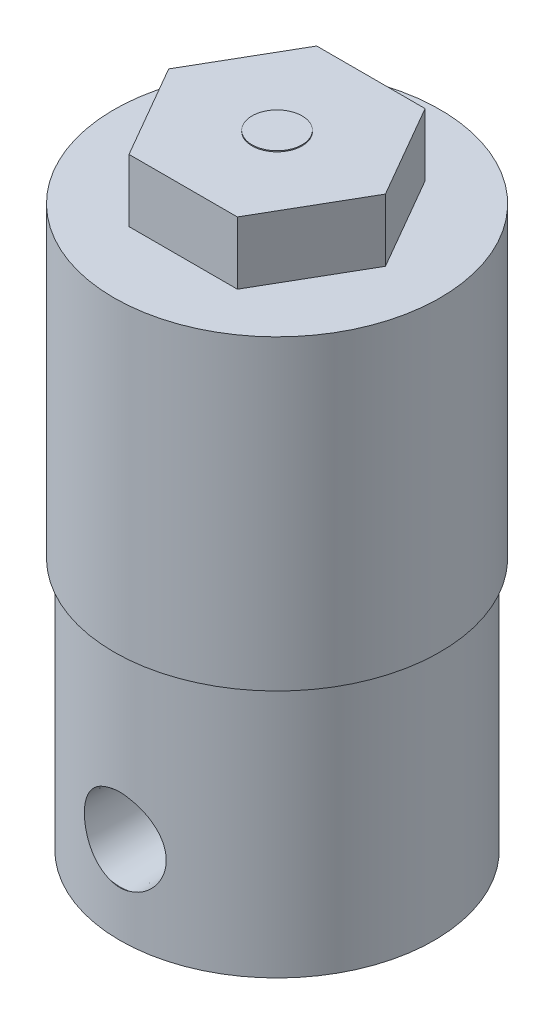
ISO-10303-21;
HEADER;
FILE_DESCRIPTION(('STEP AP214'),'2;1');
FILE_NAME('part.step','',(''),(''),'','','');
FILE_SCHEMA(('AUTOMOTIVE_DESIGN { 1 0 10303 214 1 1 1 1 }'));
ENDSEC;
DATA;
#1=APPLICATION_CONTEXT('core data for automotive mechanical design processes');
#2=APPLICATION_PROTOCOL_DEFINITION('international standard','automotive_design',2000,#1);
#3=PRODUCT_CONTEXT('',#1,'mechanical');
#4=PRODUCT('Part','Part','',(#3));
#5=PRODUCT_RELATED_PRODUCT_CATEGORY('part','',(#4));
#6=PRODUCT_DEFINITION_FORMATION('','',#4);
#7=PRODUCT_DEFINITION_CONTEXT('part definition',#1,'design');
#8=PRODUCT_DEFINITION('design','',#6,#7);
#9=PRODUCT_DEFINITION_SHAPE('','',#8);
#10=(LENGTH_UNIT() NAMED_UNIT(*) SI_UNIT(.MILLI.,.METRE.));
#11=(NAMED_UNIT(*) PLANE_ANGLE_UNIT() SI_UNIT($,.RADIAN.));
#12=(NAMED_UNIT(*) SI_UNIT($,.STERADIAN.) SOLID_ANGLE_UNIT());
#13=UNCERTAINTY_MEASURE_WITH_UNIT(LENGTH_MEASURE(1.E-05),#10,'distance_accuracy_value','');
#14=(GEOMETRIC_REPRESENTATION_CONTEXT(3) GLOBAL_UNCERTAINTY_ASSIGNED_CONTEXT((#13)) GLOBAL_UNIT_ASSIGNED_CONTEXT((#10,
#11,#12)) REPRESENTATION_CONTEXT('',''));
#15=CARTESIAN_POINT('',(0.,0.,0.));
#16=DIRECTION('',(0.,0.,1.));
#17=DIRECTION('',(1.,0.,0.));
#18=AXIS2_PLACEMENT_3D('',#15,#16,#17);
#19=CARTESIAN_POINT('',(0.,44.7,0.));
#20=DIRECTION('',(0.,1.,0.));
#21=DIRECTION('',(0.,0.,1.));
#22=AXIS2_PLACEMENT_3D('',#19,#20,#21);
#23=PLANE('',#22);
#24=CARTESIAN_POINT('',(0.,44.7,0.));
#25=DIRECTION('',(0.,1.,0.));
#26=DIRECTION('',(0.,0.,1.));
#27=AXIS2_PLACEMENT_3D('',#24,#25,#26);
#28=CIRCLE('',#27,13.03);
#29=CARTESIAN_POINT('',(0.,44.7,13.03));
#30=VERTEX_POINT('',#29);
#31=EDGE_CURVE('E194',#30,#30,#28,.T.);
#32=ORIENTED_EDGE('',*,*,#31,.T.);
#33=EDGE_LOOP('',(#32));
#34=FACE_BOUND('',#33,.T.);
#35=DIRECTION('',(-0.5,0.,-0.866025403784439));
#36=VECTOR('',#35,1.);
#37=CARTESIAN_POINT('',(8.66025403784438,44.7,0.));
#38=LINE('',#37,#36);
#39=CARTESIAN_POINT('',(8.66025403784438,44.7,0.));
#40=VERTEX_POINT('',#39);
#41=CARTESIAN_POINT('',(4.33012701892219,44.7,-7.5));
#42=VERTEX_POINT('',#41);
#43=EDGE_CURVE('E171',#40,#42,#38,.T.);
#44=ORIENTED_EDGE('',*,*,#43,.F.);
#45=DIRECTION('',(0.5,0.,-0.866025403784439));
#46=VECTOR('',#45,1.);
#47=CARTESIAN_POINT('',(4.33012701892219,44.7,7.5));
#48=LINE('',#47,#46);
#49=CARTESIAN_POINT('',(4.33012701892219,44.7,7.5));
#50=VERTEX_POINT('',#49);
#51=EDGE_CURVE('E153',#50,#40,#48,.T.);
#52=ORIENTED_EDGE('',*,*,#51,.F.);
#53=DIRECTION('',(1.,0.,0.));
#54=VECTOR('',#53,1.);
#55=CARTESIAN_POINT('',(-4.3301270189222,44.7,7.5));
#56=LINE('',#55,#54);
#57=CARTESIAN_POINT('',(-4.3301270189222,44.7,7.5));
#58=VERTEX_POINT('',#57);
#59=EDGE_CURVE('E158',#58,#50,#56,.T.);
#60=ORIENTED_EDGE('',*,*,#59,.F.);
#61=DIRECTION('',(0.5,0.,0.866025403784439));
#62=VECTOR('',#61,1.);
#63=CARTESIAN_POINT('',(-8.66025403784439,44.7,0.));
#64=LINE('',#63,#62);
#65=CARTESIAN_POINT('',(-8.66025403784439,44.7,0.));
#66=VERTEX_POINT('',#65);
#67=EDGE_CURVE('E177',#66,#58,#64,.T.);
#68=ORIENTED_EDGE('',*,*,#67,.F.);
#69=DIRECTION('',(-0.5,0.,0.866025403784439));
#70=VECTOR('',#69,1.);
#71=CARTESIAN_POINT('',(-4.3301270189222,44.7,-7.5));
#72=LINE('',#71,#70);
#73=CARTESIAN_POINT('',(-4.3301270189222,44.7,-7.5));
#74=VERTEX_POINT('',#73);
#75=EDGE_CURVE('E175',#74,#66,#72,.T.);
#76=ORIENTED_EDGE('',*,*,#75,.F.);
#77=DIRECTION('',(-1.,0.,0.));
#78=VECTOR('',#77,1.);
#79=CARTESIAN_POINT('',(4.33012701892219,44.7,-7.5));
#80=LINE('',#79,#78);
#81=EDGE_CURVE('E173',#42,#74,#80,.T.);
#82=ORIENTED_EDGE('',*,*,#81,.F.);
#83=EDGE_LOOP('',(#44,#52,#60,#68,#76,#82));
#84=FACE_BOUND('',#83,.T.);
#85=ADVANCED_FACE('F38',(#34,#84),#23,.T.);
#86=CARTESIAN_POINT('',(0.,20.19,0.));
#87=DIRECTION('',(0.,-1.,0.));
#88=DIRECTION('',(0.,0.,-1.));
#89=AXIS2_PLACEMENT_3D('',#86,#87,#88);
#90=CYLINDRICAL_SURFACE('',#89,12.56);
#91=CARTESIAN_POINT('',(0.788898573962425,3.76276021112784,-12.5352));
#92=CARTESIAN_POINT('',(0.877992046783151,3.78498595457341,-12.5296008390974));
#93=CARTESIAN_POINT('',(0.966077384943671,3.8109787394763,-12.5230958603472));
#94=CARTESIAN_POINT('',(1.13961109990667,3.87023240902184,-12.5084937022588));
#95=CARTESIAN_POINT('',(1.22506008108899,3.90349161350886,-12.5003968910304));
#96=CARTESIAN_POINT('',(1.39260427157268,3.97696220545809,-12.4828421567203));
#97=CARTESIAN_POINT('',(1.47470476337445,4.0171620739958,-12.4733864931202));
#98=CARTESIAN_POINT('',(1.63513200473562,4.1042165458238,-12.4533725275988));
#99=CARTESIAN_POINT('',(1.71345861244122,4.15107139900257,-12.4428141842769));
#100=CARTESIAN_POINT('',(1.94193866208237,4.30108963824454,-12.4099181050226));
#101=CARTESIAN_POINT('',(2.08580376350805,4.41379985096151,-12.3863360583298));
#102=CARTESIAN_POINT('',(2.35272921182999,4.66140672481568,-12.3384253170528));
#103=CARTESIAN_POINT('',(2.4757843498136,4.79630892417696,-12.3140964373251));
#104=CARTESIAN_POINT('',(2.70011309765983,5.08758685527581,-12.2668817928073));
#105=CARTESIAN_POINT('',(2.80093263275379,5.24431928583219,-12.2440318546701));
#106=CARTESIAN_POINT('',(2.97486996361045,5.57303338337697,-12.2029414624419));
#107=CARTESIAN_POINT('',(3.04798879807883,5.74501447828084,-12.184700835522));
#108=CARTESIAN_POINT('',(3.16368465755467,6.09775236998736,-12.1551741164053));
#109=CARTESIAN_POINT('',(3.2065413683194,6.27841186841878,-12.1438244778716));
#110=CARTESIAN_POINT('',(3.26134510157559,6.64465847523464,-12.1292232211872));
#111=CARTESIAN_POINT('',(3.27329977490954,6.83024435242987,-12.1259695986019));
#112=CARTESIAN_POINT('',(3.26599978076111,7.19557037188689,-12.127936523716));
#113=CARTESIAN_POINT('',(3.24760338180706,7.37532961380296,-12.1329240344468));
#114=CARTESIAN_POINT('',(3.18184035878198,7.72909360076873,-12.1503346674747));
#115=CARTESIAN_POINT('',(3.13447183564151,7.90309796780879,-12.1627582771932));
#116=CARTESIAN_POINT('',(3.01221767228601,8.24070982304539,-12.1936086121537));
#117=CARTESIAN_POINT('',(2.93731132732565,8.40430937937475,-12.2120398531426));
#118=CARTESIAN_POINT('',(2.76213964157896,8.71677696332193,-12.2528463849831));
#119=CARTESIAN_POINT('',(2.66187043273514,8.86564273908765,-12.2752222772706));
#120=CARTESIAN_POINT('',(2.43543081707597,9.14888464802036,-12.322174501744));
#121=CARTESIAN_POINT('',(2.30860961367872,9.28273365259162,-12.3467950977331));
#122=CARTESIAN_POINT('',(2.03425744986368,9.52735745722745,-12.3949490946325));
#123=CARTESIAN_POINT('',(1.88673087447343,9.63813713065744,-12.4184827243438));
#124=CARTESIAN_POINT('',(1.58596026109721,9.82649066148048,-12.4603225808739));
#125=CARTESIAN_POINT('',(1.43389528345359,9.9058827338659,-12.4788833610702));
#126=CARTESIAN_POINT('',(1.19760875195315,10.0064711699788,-12.5030254437535));
#127=CARTESIAN_POINT('',(1.11741366372719,10.0369344736574,-12.5104607952329));
#128=CARTESIAN_POINT('',(0.954748246454062,10.0914873284702,-12.523926455648));
#129=CARTESIAN_POINT('',(0.872277369583635,10.1155753299118,-12.529956422924));
#130=CARTESIAN_POINT('',(0.788898573962424,10.1363836809308,-12.5352));
#131=B_SPLINE_CURVE_WITH_KNOTS('',3,(#91,#92,#93,#94,#95,#96,#97,#98,#99,#100,#101,#102,#103,
#104,#105,#106,#107,#108,#109,#110,#111,#112,#113,#114,#115,#116,#117,#118,#119,#120,#121,#122,
#123,#124,#125,#126,#127,#128,#129,#130),.UNSPECIFIED.,.F.,.F.,(4,2,2,2,2,2,2,2,2,2,2,2,2,2,2,2,
2,2,2,4),(0.,0.275879747322894,0.551695772578802,0.827058370161299,1.10243131008807,
1.65248922542108,2.20268462183557,2.76324638468178,3.32378712580943,3.87907697197291,
4.43422932421709,4.97395047843362,5.51370701417062,6.05387020712794,6.59411582939499,
7.14959960399937,7.70496591409256,8.22029180163628,8.47837183534944,8.73651454502424),.UNSPECIFIED.);
#132=CARTESIAN_POINT('',(0.792070072657664,3.76355342756461,-12.535));
#133=VERTEX_POINT('',#132);
#134=CARTESIAN_POINT('',(0.79207007265764,10.135590464494,-12.535));
#135=VERTEX_POINT('',#134);
#136=EDGE_CURVE('E274',#133,#135,#131,.T.);
#137=ORIENTED_EDGE('',*,*,#136,.T.);
#138=CARTESIAN_POINT('',(0.83370061173436,10.1221594357594,-12.5322999999998));
#139=CARTESIAN_POINT('',(0.75486564278842,10.1483202494265,-12.5375535391951));
#140=CARTESIAN_POINT('',(0.674763011882068,10.1708365129458,-12.542126315415));
#141=CARTESIAN_POINT('',(0.512712357209269,10.208319226797,-12.5497907538505));
#142=CARTESIAN_POINT('',(0.430763677861175,10.2232829494152,-12.552881880926));
#143=CARTESIAN_POINT('',(0.268260713697007,10.2450468578194,-12.557390330899));
#144=CARTESIAN_POINT('',(0.187739079812136,10.2520799781308,-12.5588553923057));
#145=CARTESIAN_POINT('',(0.0264203248663634,10.2586834449056,-12.5602316878031));
#146=CARTESIAN_POINT('',(-0.0543766619753039,10.2582570178965,-12.5601435936903));
#147=CARTESIAN_POINT('',(-0.252425249853426,10.2480207968119,-12.5580085982188));
#148=CARTESIAN_POINT('',(-0.369470439382227,10.2340138359144,-12.5550853323868));
#149=CARTESIAN_POINT('',(-0.603200957254121,10.1901946543597,-12.5460766067035));
#150=CARTESIAN_POINT('',(-0.719817956967926,10.160031279743,-12.5399209528179));
#151=CARTESIAN_POINT('',(-0.833700611730567,10.1221594357607,-12.5323));
#152=B_SPLINE_CURVE_WITH_KNOTS('',3,(#138,#139,#140,#141,#142,#143,#144,#145,#146,#147,#148,
#149,#150,#151),.UNSPECIFIED.,.F.,.F.,(4,2,2,2,2,2,4),(0.,0.249612733617655,0.49931555423555,
0.741475862844617,0.983531430836682,1.3361532903437,1.69677018693214),.UNSPECIFIED.);
#153=CARTESIAN_POINT('',(-0.792070072657664,10.135590464494,-12.535));
#154=VERTEX_POINT('',#153);
#155=EDGE_CURVE('E11',#135,#154,#152,.T.);
#156=ORIENTED_EDGE('',*,*,#155,.T.);
#157=CARTESIAN_POINT('',(-0.78889857396244,10.1363836809308,-12.5352));
#158=CARTESIAN_POINT('',(-0.877992046783166,10.1141579374852,-12.5296008390974));
#159=CARTESIAN_POINT('',(-0.966077384943686,10.0881651525823,-12.5230958603472));
#160=CARTESIAN_POINT('',(-1.13961109990669,10.0289114830368,-12.5084937022588));
#161=CARTESIAN_POINT('',(-1.225060081089,9.99565227854978,-12.5003968910304));
#162=CARTESIAN_POINT('',(-1.39260427157269,9.92218168660055,-12.4828421567203));
#163=CARTESIAN_POINT('',(-1.47470476337446,9.88198181806284,-12.4733864931202));
#164=CARTESIAN_POINT('',(-1.63513200473563,9.79492734623484,-12.4533725275988));
#165=CARTESIAN_POINT('',(-1.71345861244123,9.74807249305606,-12.4428141842769));
#166=CARTESIAN_POINT('',(-1.94193866208238,9.59805425381409,-12.4099181050226));
#167=CARTESIAN_POINT('',(-2.08580376350806,9.48534404109713,-12.3863360583298));
#168=CARTESIAN_POINT('',(-2.35272921183,9.23773716724295,-12.3384253170528));
#169=CARTESIAN_POINT('',(-2.47578434981361,9.10283496788167,-12.3140964373251));
#170=CARTESIAN_POINT('',(-2.70011309765984,8.81155703678282,-12.2668817928073));
#171=CARTESIAN_POINT('',(-2.8009326327538,8.65482460622644,-12.2440318546701));
#172=CARTESIAN_POINT('',(-2.97486996361046,8.32611050868166,-12.2029414624419));
#173=CARTESIAN_POINT('',(-3.04798879807884,8.15412941377779,-12.184700835522));
#174=CARTESIAN_POINT('',(-3.16368465755467,7.80139152207126,-12.1551741164053));
#175=CARTESIAN_POINT('',(-3.2065413683194,7.62073202363984,-12.1438244778716));
#176=CARTESIAN_POINT('',(-3.26134510157559,7.25448541682398,-12.1292232211872));
#177=CARTESIAN_POINT('',(-3.27329977490954,7.06889953962876,-12.1259695986019));
#178=CARTESIAN_POINT('',(-3.26599978076111,6.70357352017174,-12.127936523716));
#179=CARTESIAN_POINT('',(-3.24760338180706,6.52381427825567,-12.1329240344468));
#180=CARTESIAN_POINT('',(-3.18184035878197,6.1700502912899,-12.1503346674747));
#181=CARTESIAN_POINT('',(-3.13447183564151,5.99604592424984,-12.1627582771932));
#182=CARTESIAN_POINT('',(-3.01221767228601,5.65843406901324,-12.1936086121537));
#183=CARTESIAN_POINT('',(-2.93731132732564,5.49483451268388,-12.2120398531426));
#184=CARTESIAN_POINT('',(-2.76213964157895,5.18236692873669,-12.2528463849831));
#185=CARTESIAN_POINT('',(-2.66187043273513,5.03350115297098,-12.2752222772706));
#186=CARTESIAN_POINT('',(-2.43543081707595,4.75025924403827,-12.322174501744));
#187=CARTESIAN_POINT('',(-2.30860961367871,4.61641023946701,-12.3467950977331));
#188=CARTESIAN_POINT('',(-2.03425744986367,4.37178643483119,-12.3949490946325));
#189=CARTESIAN_POINT('',(-1.88673087447342,4.2610067614012,-12.4184827243438));
#190=CARTESIAN_POINT('',(-1.5859602610972,4.07265323057816,-12.4603225808739));
#191=CARTESIAN_POINT('',(-1.43389528345359,3.99326115819274,-12.4788833610702));
#192=CARTESIAN_POINT('',(-1.19760875195315,3.89267272207982,-12.5030254437535));
#193=CARTESIAN_POINT('',(-1.1174136637272,3.86220941840128,-12.5104607952329));
#194=CARTESIAN_POINT('',(-0.954748246454074,3.8076565635884,-12.523926455648));
#195=CARTESIAN_POINT('',(-0.872277369583649,3.78356856214681,-12.529956422924));
#196=CARTESIAN_POINT('',(-0.78889857396244,3.76276021112784,-12.5352));
#197=B_SPLINE_CURVE_WITH_KNOTS('',3,(#157,#158,#159,#160,#161,#162,#163,#164,#165,#166,#167,
#168,#169,#170,#171,#172,#173,#174,#175,#176,#177,#178,#179,#180,#181,#182,#183,#184,#185,#186,
#187,#188,#189,#190,#191,#192,#193,#194,#195,#196),.UNSPECIFIED.,.F.,.F.,(4,2,2,2,2,2,2,2,2,2,2,
2,2,2,2,2,2,2,2,4),(0.,0.275879747322895,0.551695772578802,0.827058370161299,1.10243131008807,
1.65248922542108,2.20268462183557,2.76324638468179,3.32378712580943,3.87907697197291,
4.43422932421709,4.97395047843362,5.51370701417062,6.05387020712794,6.59411582939499,
7.14959960399937,7.70496591409256,8.22029180163626,8.47837183534942,8.73651454502421),.UNSPECIFIED.);
#198=CARTESIAN_POINT('',(-0.792070072657664,3.76355342756461,-12.535));
#199=VERTEX_POINT('',#198);
#200=EDGE_CURVE('E48',#154,#199,#197,.T.);
#201=ORIENTED_EDGE('',*,*,#200,.T.);
#202=CARTESIAN_POINT('',(-0.833700611730567,3.77698445629794,-12.5323));
#203=CARTESIAN_POINT('',(-0.754865642784579,3.75082364263098,-12.5375535391953));
#204=CARTESIAN_POINT('',(-0.674763011878184,3.72830737911185,-12.5421263154152));
#205=CARTESIAN_POINT('',(-0.512712357205311,3.69082466526084,-12.5497907538507));
#206=CARTESIAN_POINT('',(-0.430763677857186,3.67586094264275,-12.5528818809261));
#207=CARTESIAN_POINT('',(-0.268260713692968,3.6540970342388,-12.557390330899));
#208=CARTESIAN_POINT('',(-0.187739079808078,3.64706391392752,-12.5588553923058));
#209=CARTESIAN_POINT('',(-0.0264203248622799,3.64046044715303,-12.5602316878031));
#210=CARTESIAN_POINT('',(0.0543766619793943,3.64088687416224,-12.5601435936902));
#211=CARTESIAN_POINT('',(0.252425249857493,3.65112309524717,-12.5580085982188));
#212=CARTESIAN_POINT('',(0.369470439386257,3.66513005614486,-12.5550853323866));
#213=CARTESIAN_POINT('',(0.603200957258053,3.70894923769991,-12.5460766067034));
#214=CARTESIAN_POINT('',(0.719817956971795,3.73911261231672,-12.5399209528177));
#215=CARTESIAN_POINT('',(0.833700611734362,3.77698445629919,-12.5322999999998));
#216=B_SPLINE_CURVE_WITH_KNOTS('',3,(#202,#203,#204,#205,#206,#207,#208,#209,#210,#211,#212,
#213,#214,#215),.UNSPECIFIED.,.F.,.F.,(4,2,2,2,2,2,4),(0.,0.249612733617679,0.499315554235597,
0.741475862844686,0.983531430836774,1.33615329034375,1.69677018693215),.UNSPECIFIED.);
#217=EDGE_CURVE('E282',#199,#133,#216,.T.);
#218=ORIENTED_EDGE('',*,*,#217,.T.);
#219=EDGE_LOOP('',(#137,#156,#201,#218));
#220=FACE_BOUND('',#219,.T.);
#221=CARTESIAN_POINT('',(-0.833700611730567,10.1325874897314,12.5323));
#222=CARTESIAN_POINT('',(-0.75486564278458,10.1587483033983,12.5375535391953));
#223=CARTESIAN_POINT('',(-0.674763011878186,10.1812645669175,12.5421263154152));
#224=CARTESIAN_POINT('',(-0.512712357205314,10.2187472807685,12.5497907538507));
#225=CARTESIAN_POINT('',(-0.430763677857189,10.2337110033866,12.5528818809261));
#226=CARTESIAN_POINT('',(-0.268260713692973,10.2554749117905,12.557390330899));
#227=CARTESIAN_POINT('',(-0.187739079808084,10.2625080321018,12.5588553923058));
#228=CARTESIAN_POINT('',(-0.0264203248622866,10.2691114988763,12.5602316878031));
#229=CARTESIAN_POINT('',(0.054376661979387,10.2686850718671,12.5601435936902));
#230=CARTESIAN_POINT('',(0.252425249857486,10.2584488507822,12.5580085982188));
#231=CARTESIAN_POINT('',(0.369470439386251,10.2444418898845,12.5550853323866));
#232=CARTESIAN_POINT('',(0.603200957258049,10.2006227083294,12.5460766067034));
#233=CARTESIAN_POINT('',(0.719817956971792,10.1704593337126,12.5399209528177));
#234=CARTESIAN_POINT('',(0.83370061173436,10.1325874897301,12.5322999999998));
#235=B_SPLINE_CURVE_WITH_KNOTS('',3,(#221,#222,#223,#224,#225,#226,#227,#228,#229,#230,#231,
#232,#233,#234),.UNSPECIFIED.,.F.,.F.,(4,2,2,2,2,2,4),(0.,0.249612733617677,0.499315554235593,
0.74147586284468,0.983531430836766,1.33615329034374,1.69677018693214),.UNSPECIFIED.);
#236=CARTESIAN_POINT('',(-0.792070072657664,10.1460185184647,12.535));
#237=VERTEX_POINT('',#236);
#238=CARTESIAN_POINT('',(0.792070072657664,10.1460185184647,12.535));
#239=VERTEX_POINT('',#238);
#240=EDGE_CURVE('E261',#237,#239,#235,.T.);
#241=ORIENTED_EDGE('',*,*,#240,.T.);
#242=CARTESIAN_POINT('',(0.788898573962424,10.1468117349015,12.5352));
#243=CARTESIAN_POINT('',(0.877992046783151,10.1245859914559,12.5296008390974));
#244=CARTESIAN_POINT('',(0.96607738494367,10.098593206553,12.5230958603472));
#245=CARTESIAN_POINT('',(1.13961109990667,10.0393395370075,12.5084937022588));
#246=CARTESIAN_POINT('',(1.22506008108899,10.0060803325205,12.5003968910304));
#247=CARTESIAN_POINT('',(1.39260427157268,9.93260974057123,12.4828421567203));
#248=CARTESIAN_POINT('',(1.47470476337444,9.89240987203353,12.4733864931202));
#249=CARTESIAN_POINT('',(1.63513200473562,9.80535540020552,12.4533725275988));
#250=CARTESIAN_POINT('',(1.71345861244122,9.75850054702675,12.4428141842769));
#251=CARTESIAN_POINT('',(1.94193866208237,9.60848230778478,12.4099181050226));
#252=CARTESIAN_POINT('',(2.08580376350804,9.49577209506782,12.3863360583298));
#253=CARTESIAN_POINT('',(2.35272921182999,9.24816522121364,12.3384253170528));
#254=CARTESIAN_POINT('',(2.4757843498136,9.11326302185236,12.3140964373251));
#255=CARTESIAN_POINT('',(2.70011309765983,8.82198509075351,12.2668817928073));
#256=CARTESIAN_POINT('',(2.80093263275379,8.66525266019713,12.2440318546701));
#257=CARTESIAN_POINT('',(2.97486996361045,8.33653856265235,12.2029414624419));
#258=CARTESIAN_POINT('',(3.04798879807883,8.16455746774849,12.184700835522));
#259=CARTESIAN_POINT('',(3.16368465755467,7.81181957604196,12.1551741164053));
#260=CARTESIAN_POINT('',(3.2065413683194,7.63116007761054,12.1438244778716));
#261=CARTESIAN_POINT('',(3.26134510157559,7.26491347079468,12.1292232211872));
#262=CARTESIAN_POINT('',(3.27329977490954,7.07932759359945,12.1259695986019));
#263=CARTESIAN_POINT('',(3.26599978076111,6.71400157414244,12.127936523716));
#264=CARTESIAN_POINT('',(3.24760338180706,6.53424233222636,12.1329240344468));
#265=CARTESIAN_POINT('',(3.18184035878198,6.1804783452606,12.1503346674747));
#266=CARTESIAN_POINT('',(3.13447183564151,6.00647397822053,12.1627582771932));
#267=CARTESIAN_POINT('',(3.01221767228601,5.66886212298394,12.1936086121537));
#268=CARTESIAN_POINT('',(2.93731132732565,5.50526256665458,12.2120398531426));
#269=CARTESIAN_POINT('',(2.76213964157896,5.19279498270739,12.2528463849831));
#270=CARTESIAN_POINT('',(2.66187043273514,5.04392920694167,12.2752222772706));
#271=CARTESIAN_POINT('',(2.43543081707597,4.76068729800896,12.322174501744));
#272=CARTESIAN_POINT('',(2.30860961367872,4.6268382934377,12.3467950977331));
#273=CARTESIAN_POINT('',(2.03425744986368,4.38221448880188,12.3949490946325));
#274=CARTESIAN_POINT('',(1.88673087447343,4.27143481537189,12.4184827243438));
#275=CARTESIAN_POINT('',(1.58596026109721,4.08308128454884,12.4603225808739));
#276=CARTESIAN_POINT('',(1.43389528345359,4.00368921216342,12.4788833610702));
#277=CARTESIAN_POINT('',(1.19760875195315,3.9031007760505,12.5030254437535));
#278=CARTESIAN_POINT('',(1.11741366372719,3.87263747237196,12.5104607952329));
#279=CARTESIAN_POINT('',(0.954748246454063,3.81808461755908,12.523926455648));
#280=CARTESIAN_POINT('',(0.872277369583636,3.79399661611748,12.529956422924));
#281=CARTESIAN_POINT('',(0.788898573962424,3.77318826509851,12.5352));
#282=B_SPLINE_CURVE_WITH_KNOTS('',3,(#242,#243,#244,#245,#246,#247,#248,#249,#250,#251,#252,
#253,#254,#255,#256,#257,#258,#259,#260,#261,#262,#263,#264,#265,#266,#267,#268,#269,#270,#271,
#272,#273,#274,#275,#276,#277,#278,#279,#280,#281),.UNSPECIFIED.,.F.,.F.,(4,2,2,2,2,2,2,2,2,2,2,
2,2,2,2,2,2,2,2,4),(0.,0.275879747322893,0.5516957725788,0.827058370161298,1.10243131008807,
1.65248922542108,2.20268462183556,2.76324638468178,3.32378712580943,3.87907697197291,
4.43422932421709,4.97395047843362,5.51370701417062,6.05387020712794,6.59411582939498,
7.14959960399936,7.70496591409256,8.22029180163627,8.47837183534944,8.73651454502424),.UNSPECIFIED.);
#283=CARTESIAN_POINT('',(0.792070072657664,3.77398148153529,12.535));
#284=VERTEX_POINT('',#283);
#285=EDGE_CURVE('E267',#239,#284,#282,.T.);
#286=ORIENTED_EDGE('',*,*,#285,.T.);
#287=CARTESIAN_POINT('',(0.833700611734362,3.78741251026987,12.5322999999998));
#288=CARTESIAN_POINT('',(0.754865642788423,3.7612516966028,12.5375535391951));
#289=CARTESIAN_POINT('',(0.674763011882071,3.73873543308355,12.542126315415));
#290=CARTESIAN_POINT('',(0.512712357209274,3.70125271923231,12.5497907538505));
#291=CARTESIAN_POINT('',(0.43076367786118,3.68628899661409,12.552881880926));
#292=CARTESIAN_POINT('',(0.268260713697014,3.6645250882099,12.557390330899));
#293=CARTESIAN_POINT('',(0.187739079812143,3.65749196789849,12.5588553923057));
#294=CARTESIAN_POINT('',(0.0264203248663719,3.65088850112375,12.5602316878031));
#295=CARTESIAN_POINT('',(-0.0543766619752948,3.65131492813283,12.5601435936903));
#296=CARTESIAN_POINT('',(-0.252425249853418,3.66155114921746,12.5580085982188));
#297=CARTESIAN_POINT('',(-0.369470439382221,3.67555811011497,12.5550853323868));
#298=CARTESIAN_POINT('',(-0.603200957254119,3.71937729166966,12.5460766067035));
#299=CARTESIAN_POINT('',(-0.719817956967925,3.74954066628631,12.5399209528179));
#300=CARTESIAN_POINT('',(-0.833700611730567,3.78741251026862,12.5323));
#301=B_SPLINE_CURVE_WITH_KNOTS('',3,(#287,#288,#289,#290,#291,#292,#293,#294,#295,#296,#297,
#298,#299,#300),.UNSPECIFIED.,.F.,.F.,(4,2,2,2,2,2,4),(0.,0.249612733617653,0.499315554235546,
0.741475862844611,0.983531430836675,1.3361532903437,1.69677018693215),.UNSPECIFIED.);
#302=CARTESIAN_POINT('',(-0.792070072657664,3.77398148153529,12.535));
#303=VERTEX_POINT('',#302);
#304=EDGE_CURVE('E232',#284,#303,#301,.T.);
#305=ORIENTED_EDGE('',*,*,#304,.T.);
#306=CARTESIAN_POINT('',(-0.788898573962439,3.77318826509852,12.5352));
#307=CARTESIAN_POINT('',(-0.877992046783166,3.7954140085441,12.5296008390974));
#308=CARTESIAN_POINT('',(-0.966077384943686,3.82140679344699,12.5230958603472));
#309=CARTESIAN_POINT('',(-1.13961109990669,3.88066046299252,12.5084937022588));
#310=CARTESIAN_POINT('',(-1.225060081089,3.91391966747954,12.5003968910304));
#311=CARTESIAN_POINT('',(-1.39260427157269,3.98739025942877,12.4828421567203));
#312=CARTESIAN_POINT('',(-1.47470476337446,4.02759012796648,12.4733864931202));
#313=CARTESIAN_POINT('',(-1.63513200473563,4.11464459979448,12.4533725275988));
#314=CARTESIAN_POINT('',(-1.71345861244123,4.16149945297326,12.4428141842769));
#315=CARTESIAN_POINT('',(-1.94193866208238,4.31151769221523,12.4099181050226));
#316=CARTESIAN_POINT('',(-2.08580376350806,4.4242279049322,12.3863360583298));
#317=CARTESIAN_POINT('',(-2.35272921183,4.67183477878637,12.3384253170528));
#318=CARTESIAN_POINT('',(-2.47578434981361,4.80673697814765,12.3140964373251));
#319=CARTESIAN_POINT('',(-2.70011309765984,5.0980149092465,12.2668817928073));
#320=CARTESIAN_POINT('',(-2.8009326327538,5.25474733980288,12.2440318546701));
#321=CARTESIAN_POINT('',(-2.97486996361045,5.58346143734766,12.2029414624419));
#322=CARTESIAN_POINT('',(-3.04798879807883,5.75544253225153,12.184700835522));
#323=CARTESIAN_POINT('',(-3.16368465755467,6.10818042395806,12.1551741164053));
#324=CARTESIAN_POINT('',(-3.2065413683194,6.28883992238948,12.1438244778716));
#325=CARTESIAN_POINT('',(-3.26134510157559,6.65508652920534,12.1292232211872));
#326=CARTESIAN_POINT('',(-3.27329977490954,6.84067240640057,12.1259695986019));
#327=CARTESIAN_POINT('',(-3.26599978076111,7.20599842585758,12.127936523716));
#328=CARTESIAN_POINT('',(-3.24760338180706,7.38575766777366,12.1329240344468));
#329=CARTESIAN_POINT('',(-3.18184035878197,7.73952165473942,12.1503346674747));
#330=CARTESIAN_POINT('',(-3.13447183564151,7.91352602177949,12.1627582771932));
#331=CARTESIAN_POINT('',(-3.01221767228601,8.25113787701608,12.1936086121537));
#332=CARTESIAN_POINT('',(-2.93731132732564,8.41473743334544,12.2120398531426));
#333=CARTESIAN_POINT('',(-2.76213964157895,8.72720501729263,12.2528463849831));
#334=CARTESIAN_POINT('',(-2.66187043273513,8.87607079305835,12.2752222772706));
#335=CARTESIAN_POINT('',(-2.43543081707595,9.15931270199105,12.322174501744));
#336=CARTESIAN_POINT('',(-2.30860961367871,9.29316170656231,12.3467950977331));
#337=CARTESIAN_POINT('',(-2.03425744986366,9.53778551119813,12.3949490946325));
#338=CARTESIAN_POINT('',(-1.88673087447342,9.64856518462813,12.4184827243438));
#339=CARTESIAN_POINT('',(-1.5859602610972,9.83691871545116,12.4603225808739));
#340=CARTESIAN_POINT('',(-1.43389528345359,9.91631078783658,12.4788833610702));
#341=CARTESIAN_POINT('',(-1.19760875195315,10.0168992239495,12.5030254437535));
#342=CARTESIAN_POINT('',(-1.11741366372719,10.047362527628,12.5104607952329));
#343=CARTESIAN_POINT('',(-0.954748246454072,10.1019153824409,12.523926455648));
#344=CARTESIAN_POINT('',(-0.872277369583648,10.1260033838825,12.529956422924));
#345=CARTESIAN_POINT('',(-0.788898573962439,10.1468117349015,12.5352));
#346=B_SPLINE_CURVE_WITH_KNOTS('',3,(#306,#307,#308,#309,#310,#311,#312,#313,#314,#315,#316,
#317,#318,#319,#320,#321,#322,#323,#324,#325,#326,#327,#328,#329,#330,#331,#332,#333,#334,#335,
#336,#337,#338,#339,#340,#341,#342,#343,#344,#345),.UNSPECIFIED.,.F.,.F.,(4,2,2,2,2,2,2,2,2,2,2,
2,2,2,2,2,2,2,2,4),(0.,0.275879747322894,0.551695772578802,0.8270583701613,1.10243131008807,
1.65248922542108,2.20268462183557,2.76324638468179,3.32378712580943,3.87907697197291,
4.43422932421709,4.97395047843362,5.51370701417062,6.05387020712794,6.59411582939499,
7.14959960399937,7.70496591409256,8.22029180163626,8.47837183534942,8.7365145450242),.UNSPECIFIED.);
#347=EDGE_CURVE('E242',#303,#237,#346,.T.);
#348=ORIENTED_EDGE('',*,*,#347,.T.);
#349=EDGE_LOOP('',(#241,#286,#305,#348));
#350=FACE_BOUND('',#349,.T.);
#351=CARTESIAN_POINT('',(0.,20.19,0.));
#352=DIRECTION('',(0.,1.,0.));
#353=DIRECTION('',(0.,0.,1.));
#354=AXIS2_PLACEMENT_3D('',#351,#352,#353);
#355=CIRCLE('',#354,12.56);
#356=CARTESIAN_POINT('',(0.,20.19,12.56));
#357=VERTEX_POINT('',#356);
#358=EDGE_CURVE('E229',#357,#357,#355,.T.);
#359=ORIENTED_EDGE('',*,*,#358,.F.);
#360=EDGE_LOOP('',(#359));
#361=FACE_BOUND('',#360,.T.);
#362=CARTESIAN_POINT('',(0.,0.,0.));
#363=DIRECTION('',(0.,1.,0.));
#364=DIRECTION('',(0.,0.,1.));
#365=AXIS2_PLACEMENT_3D('',#362,#363,#364);
#366=CIRCLE('',#365,12.56);
#367=CARTESIAN_POINT('',(0.,0.,12.56));
#368=VERTEX_POINT('',#367);
#369=EDGE_CURVE('E228',#368,#368,#366,.T.);
#370=ORIENTED_EDGE('',*,*,#369,.T.);
#371=EDGE_LOOP('',(#370));
#372=FACE_BOUND('',#371,.T.);
#373=ADVANCED_FACE('F40',(#220,#350,#361,#372),#90,.T.);
#374=CARTESIAN_POINT('',(0.,0.,0.));
#375=DIRECTION('',(0.,1.,0.));
#376=DIRECTION('',(0.,0.,1.));
#377=AXIS2_PLACEMENT_3D('',#374,#375,#376);
#378=PLANE('',#377);
#379=CARTESIAN_POINT('',(-9.33500000000009,0.,0.));
#380=DIRECTION('',(0.,-1.,0.));
#381=DIRECTION('',(0.,0.,-1.));
#382=AXIS2_PLACEMENT_3D('',#379,#380,#381);
#383=CIRCLE('',#382,2.8829);
#384=CARTESIAN_POINT('',(-9.33500000000009,0.,-2.8829));
#385=VERTEX_POINT('',#384);
#386=EDGE_CURVE('E144',#385,#385,#383,.T.);
#387=ORIENTED_EDGE('',*,*,#386,.F.);
#388=EDGE_LOOP('',(#387));
#389=FACE_BOUND('',#388,.T.);
#390=CARTESIAN_POINT('',(9.335,0.,0.));
#391=DIRECTION('',(0.,-1.,0.));
#392=DIRECTION('',(0.,0.,-1.));
#393=AXIS2_PLACEMENT_3D('',#390,#391,#392);
#394=CIRCLE('',#393,2.8829);
#395=CARTESIAN_POINT('',(9.335,0.,-2.8829));
#396=VERTEX_POINT('',#395);
#397=EDGE_CURVE('E137',#396,#396,#394,.T.);
#398=ORIENTED_EDGE('',*,*,#397,.F.);
#399=EDGE_LOOP('',(#398));
#400=FACE_BOUND('',#399,.T.);
#401=ORIENTED_EDGE('',*,*,#369,.F.);
#402=EDGE_LOOP('',(#401));
#403=FACE_BOUND('',#402,.T.);
#404=ADVANCED_FACE('F330',(#389,#400,#403),#378,.F.);
#405=CARTESIAN_POINT('',(0.,6.96,12.535));
#406=DIRECTION('',(0.,0.,1.));
#407=DIRECTION('',(1.,0.,0.));
#408=AXIS2_PLACEMENT_3D('',#405,#406,#407);
#409=CONICAL_SURFACE('',#408,3.283,0.0312064870256584);
#410=CARTESIAN_POINT('',(0.,6.96,5.16));
#411=DIRECTION('',(0.,0.,1.));
#412=DIRECTION('',(1.,0.,0.));
#413=AXIS2_PLACEMENT_3D('',#410,#411,#412);
#414=CIRCLE('',#413,3.05277741964332);
#415=CARTESIAN_POINT('',(3.05277741964332,6.96,5.16));
#416=VERTEX_POINT('',#415);
#417=EDGE_CURVE('E219',#416,#416,#414,.T.);
#418=ORIENTED_EDGE('',*,*,#417,.F.);
#419=EDGE_LOOP('',(#418));
#420=FACE_BOUND('',#419,.T.);
#421=CARTESIAN_POINT('',(0.,6.96,12.535));
#422=DIRECTION('',(0.,0.,1.));
#423=DIRECTION('',(1.,0.,0.));
#424=AXIS2_PLACEMENT_3D('',#421,#422,#423);
#425=CIRCLE('',#424,3.283);
#426=EDGE_CURVE('E216',#239,#237,#425,.T.);
#427=ORIENTED_EDGE('',*,*,#426,.T.);
#428=ORIENTED_EDGE('',*,*,#347,.F.);
#429=EDGE_CURVE('E215',#303,#284,#425,.T.);
#430=ORIENTED_EDGE('',*,*,#429,.T.);
#431=ORIENTED_EDGE('',*,*,#285,.F.);
#432=EDGE_LOOP('',(#427,#428,#430,#431));
#433=FACE_BOUND('',#432,.T.);
#434=ADVANCED_FACE('F254',(#420,#433),#409,.F.);
#435=CARTESIAN_POINT('',(0.,6.96,12.56));
#436=DIRECTION('',(0.,0.,1.));
#437=DIRECTION('',(1.,0.,0.));
#438=AXIS2_PLACEMENT_3D('',#435,#436,#437);
#439=CONICAL_SURFACE('',#438,3.308,0.785398163397431);
#440=ORIENTED_EDGE('',*,*,#426,.F.);
#441=ORIENTED_EDGE('',*,*,#240,.F.);
#442=EDGE_LOOP('',(#440,#441));
#443=FACE_BOUND('',#442,.T.);
#444=ADVANCED_FACE('F249',(#443),#439,.F.);
#445=ORIENTED_EDGE('',*,*,#429,.F.);
#446=ORIENTED_EDGE('',*,*,#304,.F.);
#447=EDGE_LOOP('',(#445,#446));
#448=FACE_BOUND('',#447,.T.);
#449=ADVANCED_FACE('F253',(#448),#439,.F.);
#450=CARTESIAN_POINT('',(0.,6.96,4.06));
#451=DIRECTION('',(0.,0.,1.));
#452=DIRECTION('',(1.,0.,0.));
#453=AXIS2_PLACEMENT_3D('',#450,#451,#452);
#454=CONICAL_SURFACE('',#453,3.95,1.02974425867665);
#455=CARTESIAN_POINT('',(0.,6.96,1.68660055484114));
#456=VERTEX_POINT('',#455);
#457=VERTEX_LOOP('',#456);
#458=FACE_BOUND('',#457,.T.);
#459=CARTESIAN_POINT('',(0.,6.96,4.06));
#460=DIRECTION('',(0.,0.,1.));
#461=DIRECTION('',(1.,0.,0.));
#462=AXIS2_PLACEMENT_3D('',#459,#460,#461);
#463=CIRCLE('',#462,3.95);
#464=CARTESIAN_POINT('',(3.95,6.96,4.06));
#465=VERTEX_POINT('',#464);
#466=EDGE_CURVE('E225',#465,#465,#463,.T.);
#467=ORIENTED_EDGE('',*,*,#466,.T.);
#468=EDGE_LOOP('',(#467));
#469=FACE_BOUND('',#468,.T.);
#470=ADVANCED_FACE('F470',(#458,#469),#454,.F.);
#471=CARTESIAN_POINT('',(0.,6.96,12.56));
#472=DIRECTION('',(0.,0.,1.));
#473=DIRECTION('',(1.,0.,0.));
#474=AXIS2_PLACEMENT_3D('',#471,#472,#473);
#475=CYLINDRICAL_SURFACE('',#474,3.95);
#476=ORIENTED_EDGE('',*,*,#466,.F.);
#477=EDGE_LOOP('',(#476));
#478=FACE_BOUND('',#477,.T.);
#479=CARTESIAN_POINT('',(0.,6.96,5.16));
#480=DIRECTION('',(0.,0.,1.));
#481=DIRECTION('',(1.,0.,0.));
#482=AXIS2_PLACEMENT_3D('',#479,#480,#481);
#483=CIRCLE('',#482,3.95);
#484=CARTESIAN_POINT('',(3.95,6.96,5.16));
#485=VERTEX_POINT('',#484);
#486=EDGE_CURVE('E222',#485,#485,#483,.T.);
#487=ORIENTED_EDGE('',*,*,#486,.T.);
#488=EDGE_LOOP('',(#487));
#489=FACE_BOUND('',#488,.T.);
#490=ADVANCED_FACE('F322',(#478,#489),#475,.F.);
#491=CARTESIAN_POINT('',(3.95,6.96,5.16));
#492=DIRECTION('',(0.,0.,1.));
#493=DIRECTION('',(1.,0.,0.));
#494=AXIS2_PLACEMENT_3D('',#491,#492,#493);
#495=PLANE('',#494);
#496=ORIENTED_EDGE('',*,*,#486,.F.);
#497=EDGE_LOOP('',(#496));
#498=FACE_BOUND('',#497,.T.);
#499=ORIENTED_EDGE('',*,*,#417,.T.);
#500=EDGE_LOOP('',(#499));
#501=FACE_BOUND('',#500,.T.);
#502=ADVANCED_FACE('F317',(#498,#501),#495,.F.);
#503=CARTESIAN_POINT('',(0.,6.94957194602932,-12.56));
#504=DIRECTION('',(0.,0.,-1.));
#505=DIRECTION('',(-1.,0.,0.));
#506=AXIS2_PLACEMENT_3D('',#503,#504,#505);
#507=CONICAL_SURFACE('',#506,3.308,0.785398163397414);
#508=CARTESIAN_POINT('',(0.,6.94957194602932,-12.535));
#509=DIRECTION('',(0.,0.,-1.));
#510=DIRECTION('',(-1.,0.,0.));
#511=AXIS2_PLACEMENT_3D('',#508,#509,#510);
#512=CIRCLE('',#511,3.283);
#513=EDGE_CURVE('E204',#154,#135,#512,.T.);
#514=ORIENTED_EDGE('',*,*,#513,.F.);
#515=ORIENTED_EDGE('',*,*,#155,.F.);
#516=EDGE_LOOP('',(#514,#515));
#517=FACE_BOUND('',#516,.T.);
#518=ADVANCED_FACE('F295',(#517),#507,.F.);
#519=EDGE_CURVE('E203',#133,#199,#512,.T.);
#520=ORIENTED_EDGE('',*,*,#519,.F.);
#521=ORIENTED_EDGE('',*,*,#217,.F.);
#522=EDGE_LOOP('',(#520,#521));
#523=FACE_BOUND('',#522,.T.);
#524=ADVANCED_FACE('F293',(#523),#507,.F.);
#525=CARTESIAN_POINT('',(0.,6.94957194602932,-12.535));
#526=DIRECTION('',(0.,0.,-1.));
#527=DIRECTION('',(-1.,0.,0.));
#528=AXIS2_PLACEMENT_3D('',#525,#526,#527);
#529=CONICAL_SURFACE('',#528,3.283,0.0312064870256583);
#530=CARTESIAN_POINT('',(0.,6.94957194602932,-5.16));
#531=DIRECTION('',(0.,0.,-1.));
#532=DIRECTION('',(-1.,0.,0.));
#533=AXIS2_PLACEMENT_3D('',#530,#531,#532);
#534=CIRCLE('',#533,3.05277741964332);
#535=CARTESIAN_POINT('',(-3.05277741964332,6.94957194602932,-5.16));
#536=VERTEX_POINT('',#535);
#537=EDGE_CURVE('E206',#536,#536,#534,.T.);
#538=ORIENTED_EDGE('',*,*,#537,.F.);
#539=EDGE_LOOP('',(#538));
#540=FACE_BOUND('',#539,.T.);
#541=ORIENTED_EDGE('',*,*,#513,.T.);
#542=ORIENTED_EDGE('',*,*,#136,.F.);
#543=ORIENTED_EDGE('',*,*,#519,.T.);
#544=ORIENTED_EDGE('',*,*,#200,.F.);
#545=EDGE_LOOP('',(#541,#542,#543,#544));
#546=FACE_BOUND('',#545,.T.);
#547=ADVANCED_FACE('F289',(#540,#546),#529,.F.);
#548=CARTESIAN_POINT('',(0.,6.94957194602932,-4.06000000000001));
#549=DIRECTION('',(0.,0.,-1.));
#550=DIRECTION('',(-1.,0.,0.));
#551=AXIS2_PLACEMENT_3D('',#548,#549,#550);
#552=CONICAL_SURFACE('',#551,3.95000000000001,1.02974425867666);
#553=CARTESIAN_POINT('',(0.,6.94957194602932,-1.68660055484114));
#554=VERTEX_POINT('',#553);
#555=VERTEX_LOOP('',#554);
#556=FACE_BOUND('',#555,.T.);
#557=CARTESIAN_POINT('',(0.,6.94957194602932,-4.06000000000001));
#558=DIRECTION('',(0.,0.,-1.));
#559=DIRECTION('',(-1.,0.,0.));
#560=AXIS2_PLACEMENT_3D('',#557,#558,#559);
#561=CIRCLE('',#560,3.95000000000001);
#562=CARTESIAN_POINT('',(-3.95000000000001,6.94957194602932,-4.06000000000001));
#563=VERTEX_POINT('',#562);
#564=EDGE_CURVE('E212',#563,#563,#561,.T.);
#565=ORIENTED_EDGE('',*,*,#564,.T.);
#566=EDGE_LOOP('',(#565));
#567=FACE_BOUND('',#566,.T.);
#568=ADVANCED_FACE('F256',(#556,#567),#552,.F.);
#569=CARTESIAN_POINT('',(0.,6.94957194602932,-12.56));
#570=DIRECTION('',(0.,0.,-1.));
#571=DIRECTION('',(-1.,0.,0.));
#572=AXIS2_PLACEMENT_3D('',#569,#570,#571);
#573=CYLINDRICAL_SURFACE('',#572,3.95000000000001);
#574=ORIENTED_EDGE('',*,*,#564,.F.);
#575=EDGE_LOOP('',(#574));
#576=FACE_BOUND('',#575,.T.);
#577=CARTESIAN_POINT('',(0.,6.94957194602932,-5.16));
#578=DIRECTION('',(0.,0.,-1.));
#579=DIRECTION('',(-1.,0.,0.));
#580=AXIS2_PLACEMENT_3D('',#577,#578,#579);
#581=CIRCLE('',#580,3.95000000000001);
#582=CARTESIAN_POINT('',(-3.95000000000001,6.94957194602932,-5.16));
#583=VERTEX_POINT('',#582);
#584=EDGE_CURVE('E209',#583,#583,#581,.T.);
#585=ORIENTED_EDGE('',*,*,#584,.T.);
#586=EDGE_LOOP('',(#585));
#587=FACE_BOUND('',#586,.T.);
#588=ADVANCED_FACE('F422',(#576,#587),#573,.F.);
#589=CARTESIAN_POINT('',(3.95000000000001,6.94957194602932,-5.16));
#590=DIRECTION('',(0.,0.,-1.));
#591=DIRECTION('',(-1.,0.,0.));
#592=AXIS2_PLACEMENT_3D('',#589,#590,#591);
#593=PLANE('',#592);
#594=ORIENTED_EDGE('',*,*,#584,.F.);
#595=EDGE_LOOP('',(#594));
#596=FACE_BOUND('',#595,.T.);
#597=ORIENTED_EDGE('',*,*,#537,.T.);
#598=EDGE_LOOP('',(#597));
#599=FACE_BOUND('',#598,.T.);
#600=ADVANCED_FACE('F298',(#596,#599),#593,.F.);
#601=CARTESIAN_POINT('',(0.,44.7,0.));
#602=DIRECTION('',(0.,-1.,0.));
#603=DIRECTION('',(0.,0.,-1.));
#604=AXIS2_PLACEMENT_3D('',#601,#602,#603);
#605=CYLINDRICAL_SURFACE('',#604,13.03);
#606=ORIENTED_EDGE('',*,*,#31,.F.);
#607=EDGE_LOOP('',(#606));
#608=FACE_BOUND('',#607,.T.);
#609=CARTESIAN_POINT('',(0.,20.19,0.));
#610=DIRECTION('',(0.,1.,0.));
#611=DIRECTION('',(0.,0.,1.));
#612=AXIS2_PLACEMENT_3D('',#609,#610,#611);
#613=CIRCLE('',#612,13.03);
#614=CARTESIAN_POINT('',(0.,20.19,13.03));
#615=VERTEX_POINT('',#614);
#616=EDGE_CURVE('E198',#615,#615,#613,.T.);
#617=ORIENTED_EDGE('',*,*,#616,.T.);
#618=EDGE_LOOP('',(#617));
#619=FACE_BOUND('',#618,.T.);
#620=ADVANCED_FACE('F339',(#608,#619),#605,.T.);
#621=CARTESIAN_POINT('',(0.,20.19,0.));
#622=DIRECTION('',(0.,1.,0.));
#623=DIRECTION('',(0.,0.,1.));
#624=AXIS2_PLACEMENT_3D('',#621,#622,#623);
#625=PLANE('',#624);
#626=ORIENTED_EDGE('',*,*,#358,.T.);
#627=EDGE_LOOP('',(#626));
#628=FACE_BOUND('',#627,.T.);
#629=ORIENTED_EDGE('',*,*,#616,.F.);
#630=EDGE_LOOP('',(#629));
#631=FACE_BOUND('',#630,.T.);
#632=ADVANCED_FACE('F336',(#628,#631),#625,.F.);
#633=CARTESIAN_POINT('',(4.33012701892219,49.7,7.5));
#634=DIRECTION('',(-0.866025403784439,0.,-0.5));
#635=DIRECTION('',(-0.5,0.,0.866025403784439));
#636=AXIS2_PLACEMENT_3D('',#633,#634,#635);
#637=PLANE('',#636);
#638=ORIENTED_EDGE('',*,*,#51,.T.);
#639=DIRECTION('',(0.,-1.,0.));
#640=VECTOR('',#639,1.);
#641=CARTESIAN_POINT('',(8.66025403784438,49.7,0.));
#642=LINE('',#641,#640);
#643=CARTESIAN_POINT('',(8.66025403784438,49.7,0.));
#644=VERTEX_POINT('',#643);
#645=EDGE_CURVE('E192',#644,#40,#642,.T.);
#646=ORIENTED_EDGE('',*,*,#645,.F.);
#647=DIRECTION('',(0.5,0.,-0.866025403784439));
#648=VECTOR('',#647,1.);
#649=CARTESIAN_POINT('',(4.33012701892219,49.7,7.5));
#650=LINE('',#649,#648);
#651=CARTESIAN_POINT('',(4.33012701892219,49.7,7.5));
#652=VERTEX_POINT('',#651);
#653=EDGE_CURVE('E154',#652,#644,#650,.T.);
#654=ORIENTED_EDGE('',*,*,#653,.F.);
#655=DIRECTION('',(0.,-1.,0.));
#656=VECTOR('',#655,1.);
#657=CARTESIAN_POINT('',(4.33012701892219,49.7,7.5));
#658=LINE('',#657,#656);
#659=EDGE_CURVE('E168',#652,#50,#658,.T.);
#660=ORIENTED_EDGE('',*,*,#659,.T.);
#661=EDGE_LOOP('',(#638,#646,#654,#660));
#662=FACE_BOUND('',#661,.T.);
#663=ADVANCED_FACE('F334',(#662),#637,.F.);
#664=CARTESIAN_POINT('',(8.66025403784438,49.7,0.));
#665=DIRECTION('',(-0.866025403784439,0.,0.5));
#666=DIRECTION('',(0.5,0.,0.866025403784439));
#667=AXIS2_PLACEMENT_3D('',#664,#665,#666);
#668=PLANE('',#667);
#669=ORIENTED_EDGE('',*,*,#43,.T.);
#670=DIRECTION('',(0.,-1.,0.));
#671=VECTOR('',#670,1.);
#672=CARTESIAN_POINT('',(4.33012701892219,49.7,-7.5));
#673=LINE('',#672,#671);
#674=CARTESIAN_POINT('',(4.33012701892219,49.7,-7.5));
#675=VERTEX_POINT('',#674);
#676=EDGE_CURVE('E189',#675,#42,#673,.T.);
#677=ORIENTED_EDGE('',*,*,#676,.F.);
#678=DIRECTION('',(-0.5,0.,-0.866025403784439));
#679=VECTOR('',#678,1.);
#680=CARTESIAN_POINT('',(8.66025403784438,49.7,0.));
#681=LINE('',#680,#679);
#682=EDGE_CURVE('E157',#644,#675,#681,.T.);
#683=ORIENTED_EDGE('',*,*,#682,.F.);
#684=ORIENTED_EDGE('',*,*,#645,.T.);
#685=EDGE_LOOP('',(#669,#677,#683,#684));
#686=FACE_BOUND('',#685,.T.);
#687=ADVANCED_FACE('F375',(#686),#668,.F.);
#688=CARTESIAN_POINT('',(4.33012701892219,49.7,-7.5));
#689=DIRECTION('',(0.,0.,1.));
#690=DIRECTION('',(1.,0.,0.));
#691=AXIS2_PLACEMENT_3D('',#688,#689,#690);
#692=PLANE('',#691);
#693=ORIENTED_EDGE('',*,*,#81,.T.);
#694=DIRECTION('',(0.,-1.,0.));
#695=VECTOR('',#694,1.);
#696=CARTESIAN_POINT('',(-4.3301270189222,49.7,-7.5));
#697=LINE('',#696,#695);
#698=CARTESIAN_POINT('',(-4.3301270189222,49.7,-7.5));
#699=VERTEX_POINT('',#698);
#700=EDGE_CURVE('E186',#699,#74,#697,.T.);
#701=ORIENTED_EDGE('',*,*,#700,.F.);
#702=DIRECTION('',(-1.,0.,0.));
#703=VECTOR('',#702,1.);
#704=CARTESIAN_POINT('',(4.33012701892219,49.7,-7.5));
#705=LINE('',#704,#703);
#706=EDGE_CURVE('E160',#675,#699,#705,.T.);
#707=ORIENTED_EDGE('',*,*,#706,.F.);
#708=ORIENTED_EDGE('',*,*,#676,.T.);
#709=EDGE_LOOP('',(#693,#701,#707,#708));
#710=FACE_BOUND('',#709,.T.);
#711=ADVANCED_FACE('F380',(#710),#692,.F.);
#712=CARTESIAN_POINT('',(-4.3301270189222,49.7,-7.5));
#713=DIRECTION('',(0.866025403784439,0.,0.5));
#714=DIRECTION('',(0.5,0.,-0.866025403784439));
#715=AXIS2_PLACEMENT_3D('',#712,#713,#714);
#716=PLANE('',#715);
#717=ORIENTED_EDGE('',*,*,#75,.T.);
#718=DIRECTION('',(0.,-1.,0.));
#719=VECTOR('',#718,1.);
#720=CARTESIAN_POINT('',(-8.66025403784439,49.7,0.));
#721=LINE('',#720,#719);
#722=CARTESIAN_POINT('',(-8.66025403784439,49.7,0.));
#723=VERTEX_POINT('',#722);
#724=EDGE_CURVE('E183',#723,#66,#721,.T.);
#725=ORIENTED_EDGE('',*,*,#724,.F.);
#726=DIRECTION('',(-0.5,0.,0.866025403784439));
#727=VECTOR('',#726,1.);
#728=CARTESIAN_POINT('',(-4.3301270189222,49.7,-7.5));
#729=LINE('',#728,#727);
#730=EDGE_CURVE('E162',#699,#723,#729,.T.);
#731=ORIENTED_EDGE('',*,*,#730,.F.);
#732=ORIENTED_EDGE('',*,*,#700,.T.);
#733=EDGE_LOOP('',(#717,#725,#731,#732));
#734=FACE_BOUND('',#733,.T.);
#735=ADVANCED_FACE('F385',(#734),#716,.F.);
#736=CARTESIAN_POINT('',(-8.66025403784439,49.7,0.));
#737=DIRECTION('',(0.866025403784439,0.,-0.5));
#738=DIRECTION('',(-0.5,0.,-0.866025403784439));
#739=AXIS2_PLACEMENT_3D('',#736,#737,#738);
#740=PLANE('',#739);
#741=ORIENTED_EDGE('',*,*,#67,.T.);
#742=DIRECTION('',(0.,-1.,0.));
#743=VECTOR('',#742,1.);
#744=CARTESIAN_POINT('',(-4.3301270189222,49.7,7.5));
#745=LINE('',#744,#743);
#746=CARTESIAN_POINT('',(-4.3301270189222,49.7,7.5));
#747=VERTEX_POINT('',#746);
#748=EDGE_CURVE('E55',#747,#58,#745,.T.);
#749=ORIENTED_EDGE('',*,*,#748,.F.);
#750=DIRECTION('',(0.5,0.,0.866025403784439));
#751=VECTOR('',#750,1.);
#752=CARTESIAN_POINT('',(-8.66025403784439,49.7,0.));
#753=LINE('',#752,#751);
#754=EDGE_CURVE('E164',#723,#747,#753,.T.);
#755=ORIENTED_EDGE('',*,*,#754,.F.);
#756=ORIENTED_EDGE('',*,*,#724,.T.);
#757=EDGE_LOOP('',(#741,#749,#755,#756));
#758=FACE_BOUND('',#757,.T.);
#759=ADVANCED_FACE('F389',(#758),#740,.F.);
#760=CARTESIAN_POINT('',(-4.3301270189222,49.7,7.5));
#761=DIRECTION('',(0.,0.,-1.));
#762=DIRECTION('',(-1.,0.,0.));
#763=AXIS2_PLACEMENT_3D('',#760,#761,#762);
#764=PLANE('',#763);
#765=ORIENTED_EDGE('',*,*,#59,.T.);
#766=ORIENTED_EDGE('',*,*,#659,.F.);
#767=DIRECTION('',(1.,0.,0.));
#768=VECTOR('',#767,1.);
#769=CARTESIAN_POINT('',(-4.3301270189222,49.7,7.5));
#770=LINE('',#769,#768);
#771=EDGE_CURVE('E166',#747,#652,#770,.T.);
#772=ORIENTED_EDGE('',*,*,#771,.F.);
#773=ORIENTED_EDGE('',*,*,#748,.T.);
#774=EDGE_LOOP('',(#765,#766,#772,#773));
#775=FACE_BOUND('',#774,.T.);
#776=ADVANCED_FACE('F365',(#775),#764,.F.);
#777=CARTESIAN_POINT('',(0.,49.7,0.));
#778=DIRECTION('',(0.,1.,0.));
#779=DIRECTION('',(0.,0.,1.));
#780=AXIS2_PLACEMENT_3D('',#777,#778,#779);
#781=PLANE('',#780);
#782=CARTESIAN_POINT('',(0.,49.7,0.));
#783=DIRECTION('',(0.,1.,0.));
#784=DIRECTION('',(0.,0.,1.));
#785=AXIS2_PLACEMENT_3D('',#782,#783,#784);
#786=CIRCLE('',#785,2.);
#787=CARTESIAN_POINT('',(0.,49.7,2.));
#788=VERTEX_POINT('',#787);
#789=EDGE_CURVE('E43',#788,#788,#786,.T.);
#790=ORIENTED_EDGE('',*,*,#789,.F.);
#791=EDGE_LOOP('',(#790));
#792=FACE_BOUND('',#791,.T.);
#793=ORIENTED_EDGE('',*,*,#653,.T.);
#794=ORIENTED_EDGE('',*,*,#682,.T.);
#795=ORIENTED_EDGE('',*,*,#706,.T.);
#796=ORIENTED_EDGE('',*,*,#730,.T.);
#797=ORIENTED_EDGE('',*,*,#754,.T.);
#798=ORIENTED_EDGE('',*,*,#771,.T.);
#799=EDGE_LOOP('',(#793,#794,#795,#796,#797,#798));
#800=FACE_BOUND('',#799,.T.);
#801=ADVANCED_FACE('F347',(#792,#800),#781,.T.);
#802=CARTESIAN_POINT('',(0.,49.78,0.));
#803=DIRECTION('',(0.,1.,0.));
#804=DIRECTION('',(0.,0.,1.));
#805=AXIS2_PLACEMENT_3D('',#802,#803,#804);
#806=PLANE('',#805);
#807=CARTESIAN_POINT('',(0.,49.78,0.));
#808=DIRECTION('',(0.,1.,0.));
#809=DIRECTION('',(0.,0.,1.));
#810=AXIS2_PLACEMENT_3D('',#807,#808,#809);
#811=CIRCLE('',#810,2.);
#812=CARTESIAN_POINT('',(0.,49.78,2.));
#813=VERTEX_POINT('',#812);
#814=EDGE_CURVE('E197',#813,#813,#811,.T.);
#815=ORIENTED_EDGE('',*,*,#814,.T.);
#816=EDGE_LOOP('',(#815));
#817=FACE_BOUND('',#816,.T.);
#818=ADVANCED_FACE('F344',(#817),#806,.T.);
#819=CARTESIAN_POINT('',(0.,49.78,0.));
#820=DIRECTION('',(0.,-1.,0.));
#821=DIRECTION('',(0.,0.,-1.));
#822=AXIS2_PLACEMENT_3D('',#819,#820,#821);
#823=CYLINDRICAL_SURFACE('',#822,2.);
#824=ORIENTED_EDGE('',*,*,#789,.T.);
#825=EDGE_LOOP('',(#824));
#826=FACE_BOUND('',#825,.T.);
#827=ORIENTED_EDGE('',*,*,#814,.F.);
#828=EDGE_LOOP('',(#827));
#829=FACE_BOUND('',#828,.T.);
#830=ADVANCED_FACE('F346',(#826,#829),#823,.T.);
#831=CARTESIAN_POINT('',(9.335,8.64932541448795,0.));
#832=DIRECTION('',(0.,-1.,0.));
#833=DIRECTION('',(0.,0.,-1.));
#834=AXIS2_PLACEMENT_3D('',#831,#832,#833);
#835=CONICAL_SURFACE('',#834,2.2479,1.02974425867665);
#836=CARTESIAN_POINT('',(9.335,10.,0.));
#837=VERTEX_POINT('',#836);
#838=VERTEX_LOOP('',#837);
#839=FACE_BOUND('',#838,.T.);
#840=CARTESIAN_POINT('',(9.335,8.64932541448795,0.));
#841=DIRECTION('',(0.,-1.,0.));
#842=DIRECTION('',(0.,0.,-1.));
#843=AXIS2_PLACEMENT_3D('',#840,#841,#842);
#844=CIRCLE('',#843,2.2479);
#845=CARTESIAN_POINT('',(9.335,8.64932541448795,-2.2479));
#846=VERTEX_POINT('',#845);
#847=EDGE_CURVE('E150',#846,#846,#844,.T.);
#848=ORIENTED_EDGE('',*,*,#847,.T.);
#849=EDGE_LOOP('',(#848));
#850=FACE_BOUND('',#849,.T.);
#851=ADVANCED_FACE('F350',(#839,#850),#835,.F.);
#852=CARTESIAN_POINT('',(9.335,0.,0.));
#853=DIRECTION('',(0.,-1.,0.));
#854=DIRECTION('',(0.,0.,-1.));
#855=AXIS2_PLACEMENT_3D('',#852,#853,#854);
#856=CYLINDRICAL_SURFACE('',#855,2.2479);
#857=ORIENTED_EDGE('',*,*,#847,.F.);
#858=EDGE_LOOP('',(#857));
#859=FACE_BOUND('',#858,.T.);
#860=CARTESIAN_POINT('',(9.335,0.635000000000002,0.));
#861=DIRECTION('',(0.,-1.,0.));
#862=DIRECTION('',(0.,0.,-1.));
#863=AXIS2_PLACEMENT_3D('',#860,#861,#862);
#864=CIRCLE('',#863,2.2479);
#865=CARTESIAN_POINT('',(9.335,0.635000000000002,-2.2479));
#866=VERTEX_POINT('',#865);
#867=EDGE_CURVE('E141',#866,#866,#864,.T.);
#868=ORIENTED_EDGE('',*,*,#867,.T.);
#869=EDGE_LOOP('',(#868));
#870=FACE_BOUND('',#869,.T.);
#871=ADVANCED_FACE('F355',(#859,#870),#856,.F.);
#872=CARTESIAN_POINT('',(9.335,0.,0.));
#873=DIRECTION('',(0.,-1.,0.));
#874=DIRECTION('',(0.,0.,-1.));
#875=AXIS2_PLACEMENT_3D('',#872,#873,#874);
#876=CONICAL_SURFACE('',#875,2.8829,0.785398163397447);
#877=ORIENTED_EDGE('',*,*,#867,.F.);
#878=EDGE_LOOP('',(#877));
#879=FACE_BOUND('',#878,.T.);
#880=ORIENTED_EDGE('',*,*,#397,.T.);
#881=EDGE_LOOP('',(#880));
#882=FACE_BOUND('',#881,.T.);
#883=ADVANCED_FACE('F131',(#879,#882),#876,.F.);
#884=CARTESIAN_POINT('',(-9.33500000000009,8.64932541448795,0.));
#885=DIRECTION('',(0.,-1.,0.));
#886=DIRECTION('',(0.,0.,-1.));
#887=AXIS2_PLACEMENT_3D('',#884,#885,#886);
#888=CONICAL_SURFACE('',#887,2.2479,1.02974425867665);
#889=CARTESIAN_POINT('',(-9.3350000000001,10.,0.));
#890=VERTEX_POINT('',#889);
#891=VERTEX_LOOP('',#890);
#892=FACE_BOUND('',#891,.T.);
#893=CARTESIAN_POINT('',(-9.33500000000009,8.64932541448795,0.));
#894=DIRECTION('',(0.,-1.,0.));
#895=DIRECTION('',(0.,0.,-1.));
#896=AXIS2_PLACEMENT_3D('',#893,#894,#895);
#897=CIRCLE('',#896,2.2479);
#898=CARTESIAN_POINT('',(-9.33500000000009,8.64932541448795,-2.2479));
#899=VERTEX_POINT('',#898);
#900=EDGE_CURVE('E135',#899,#899,#897,.T.);
#901=ORIENTED_EDGE('',*,*,#900,.T.);
#902=EDGE_LOOP('',(#901));
#903=FACE_BOUND('',#902,.T.);
#904=ADVANCED_FACE('F127',(#892,#903),#888,.F.);
#905=CARTESIAN_POINT('',(-9.33500000000009,0.,0.));
#906=DIRECTION('',(0.,-1.,0.));
#907=DIRECTION('',(0.,0.,-1.));
#908=AXIS2_PLACEMENT_3D('',#905,#906,#907);
#909=CYLINDRICAL_SURFACE('',#908,2.2479);
#910=ORIENTED_EDGE('',*,*,#900,.F.);
#911=EDGE_LOOP('',(#910));
#912=FACE_BOUND('',#911,.T.);
#913=CARTESIAN_POINT('',(-9.33500000000009,0.635000000000002,0.));
#914=DIRECTION('',(0.,-1.,0.));
#915=DIRECTION('',(0.,0.,-1.));
#916=AXIS2_PLACEMENT_3D('',#913,#914,#915);
#917=CIRCLE('',#916,2.2479);
#918=CARTESIAN_POINT('',(-9.33500000000009,0.635000000000002,-2.2479));
#919=VERTEX_POINT('',#918);
#920=EDGE_CURVE('E138',#919,#919,#917,.T.);
#921=ORIENTED_EDGE('',*,*,#920,.T.);
#922=EDGE_LOOP('',(#921));
#923=FACE_BOUND('',#922,.T.);
#924=ADVANCED_FACE('F130',(#912,#923),#909,.F.);
#925=CARTESIAN_POINT('',(-9.33500000000009,0.,0.));
#926=DIRECTION('',(0.,-1.,0.));
#927=DIRECTION('',(0.,0.,-1.));
#928=AXIS2_PLACEMENT_3D('',#925,#926,#927);
#929=CONICAL_SURFACE('',#928,2.8829,0.785398163397448);
#930=ORIENTED_EDGE('',*,*,#920,.F.);
#931=EDGE_LOOP('',(#930));
#932=FACE_BOUND('',#931,.T.);
#933=ORIENTED_EDGE('',*,*,#386,.T.);
#934=EDGE_LOOP('',(#933));
#935=FACE_BOUND('',#934,.T.);
#936=ADVANCED_FACE('F551',(#932,#935),#929,.F.);
#937=CLOSED_SHELL('',(#85,#373,#404,#434,#444,#449,#470,#490,#502,#518,#524,#547,#568,#588,#600,
#620,#632,#663,#687,#711,#735,#759,#776,#801,#818,#830,#851,#871,#883,#904,#924,#936));
#938=MANIFOLD_SOLID_BREP('B2',#937);
#939=ADVANCED_BREP_SHAPE_REPRESENTATION('',(#18,#938),#14);
#940=SHAPE_DEFINITION_REPRESENTATION(#9,#939);
ENDSEC;
END-ISO-10303-21;
